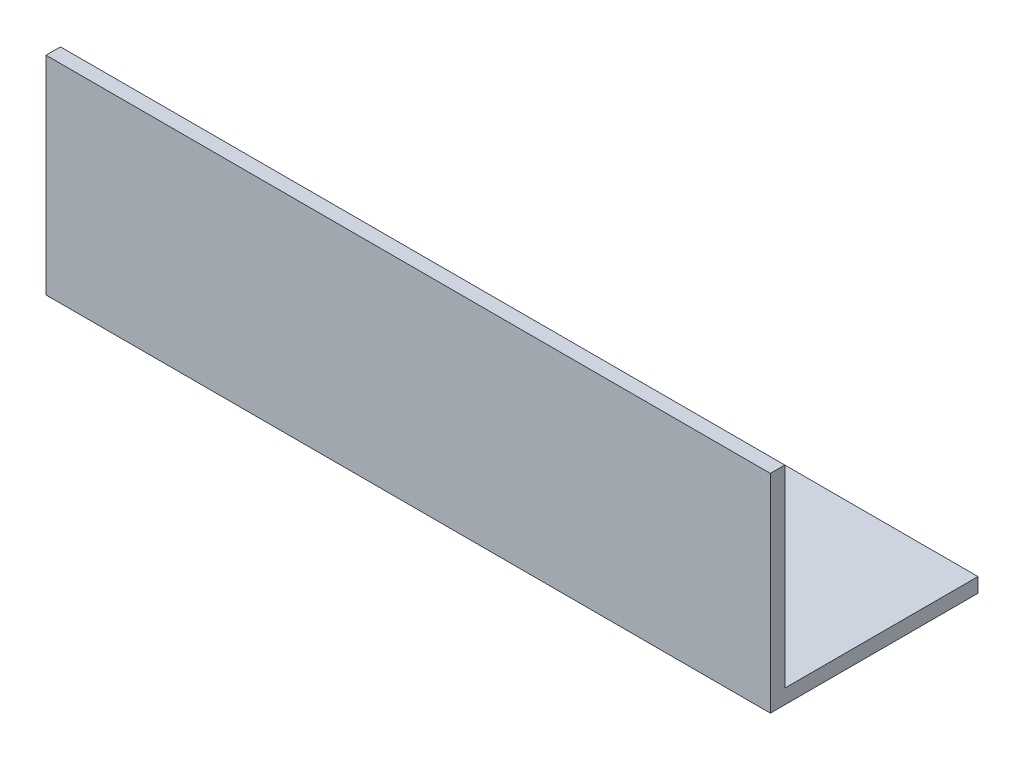
ISO-10303-21;
HEADER;
FILE_DESCRIPTION(('STEP AP214'),'2;1');
FILE_NAME('part.step','',(''),(''),'','','');
FILE_SCHEMA(('AUTOMOTIVE_DESIGN { 1 0 10303 214 1 1 1 1 }'));
ENDSEC;
DATA;
#1=APPLICATION_CONTEXT('core data for automotive mechanical design processes');
#2=APPLICATION_PROTOCOL_DEFINITION('international standard','automotive_design',2000,#1);
#3=PRODUCT_CONTEXT('',#1,'mechanical');
#4=PRODUCT('Part','Part','',(#3));
#5=PRODUCT_RELATED_PRODUCT_CATEGORY('part','',(#4));
#6=PRODUCT_DEFINITION_FORMATION('','',#4);
#7=PRODUCT_DEFINITION_CONTEXT('part definition',#1,'design');
#8=PRODUCT_DEFINITION('design','',#6,#7);
#9=PRODUCT_DEFINITION_SHAPE('','',#8);
#10=(LENGTH_UNIT() NAMED_UNIT(*) SI_UNIT(.MILLI.,.METRE.));
#11=(NAMED_UNIT(*) PLANE_ANGLE_UNIT() SI_UNIT($,.RADIAN.));
#12=(NAMED_UNIT(*) SI_UNIT($,.STERADIAN.) SOLID_ANGLE_UNIT());
#13=UNCERTAINTY_MEASURE_WITH_UNIT(LENGTH_MEASURE(1.E-05),#10,'distance_accuracy_value','');
#14=(GEOMETRIC_REPRESENTATION_CONTEXT(3) GLOBAL_UNCERTAINTY_ASSIGNED_CONTEXT((#13)) GLOBAL_UNIT_ASSIGNED_CONTEXT((#10,
#11,#12)) REPRESENTATION_CONTEXT('',''));
#15=CARTESIAN_POINT('',(0.,0.,0.));
#16=DIRECTION('',(0.,0.,1.));
#17=DIRECTION('',(1.,0.,0.));
#18=AXIS2_PLACEMENT_3D('',#15,#16,#17);
#19=CARTESIAN_POINT('',(150.,-3.,0.));
#20=DIRECTION('',(0.,1.,0.));
#21=DIRECTION('',(0.,0.,1.));
#22=AXIS2_PLACEMENT_3D('',#19,#20,#21);
#23=PLANE('',#22);
#24=DIRECTION('',(0.,0.,-1.));
#25=VECTOR('',#24,1.);
#26=CARTESIAN_POINT('',(0.,-3.,0.));
#27=LINE('',#26,#25);
#28=CARTESIAN_POINT('',(0.,-3.,3.));
#29=VERTEX_POINT('',#28);
#30=CARTESIAN_POINT('',(0.,-3.,-40.));
#31=VERTEX_POINT('',#30);
#32=EDGE_CURVE('E125',#29,#31,#27,.T.);
#33=ORIENTED_EDGE('',*,*,#32,.T.);
#34=DIRECTION('',(-1.,0.,0.));
#35=VECTOR('',#34,1.);
#36=CARTESIAN_POINT('',(150.,-3.,-40.));
#37=LINE('',#36,#35);
#38=CARTESIAN_POINT('',(150.,-3.,-40.));
#39=VERTEX_POINT('',#38);
#40=EDGE_CURVE('E11',#39,#31,#37,.T.);
#41=ORIENTED_EDGE('',*,*,#40,.F.);
#42=DIRECTION('',(0.,0.,-1.));
#43=VECTOR('',#42,1.);
#44=CARTESIAN_POINT('',(150.,-3.,0.));
#45=LINE('',#44,#43);
#46=CARTESIAN_POINT('',(150.,-3.,3.));
#47=VERTEX_POINT('',#46);
#48=EDGE_CURVE('E86',#47,#39,#45,.T.);
#49=ORIENTED_EDGE('',*,*,#48,.F.);
#50=DIRECTION('',(-1.,0.,0.));
#51=VECTOR('',#50,1.);
#52=CARTESIAN_POINT('',(150.,-3.,3.));
#53=LINE('',#52,#51);
#54=EDGE_CURVE('E121',#47,#29,#53,.T.);
#55=ORIENTED_EDGE('',*,*,#54,.T.);
#56=EDGE_LOOP('',(#33,#41,#49,#55));
#57=FACE_BOUND('',#56,.T.);
#58=ADVANCED_FACE('F39',(#57),#23,.F.);
#59=CARTESIAN_POINT('',(150.,0.,-40.));
#60=DIRECTION('',(0.,0.,-1.));
#61=DIRECTION('',(-1.,0.,0.));
#62=AXIS2_PLACEMENT_3D('',#59,#60,#61);
#63=PLANE('',#62);
#64=DIRECTION('',(0.,-1.,0.));
#65=VECTOR('',#64,1.);
#66=CARTESIAN_POINT('',(0.,0.,-40.));
#67=LINE('',#66,#65);
#68=CARTESIAN_POINT('',(0.,0.,-40.));
#69=VERTEX_POINT('',#68);
#70=EDGE_CURVE('E129',#69,#31,#67,.T.);
#71=ORIENTED_EDGE('',*,*,#70,.F.);
#72=DIRECTION('',(-1.,0.,0.));
#73=VECTOR('',#72,1.);
#74=CARTESIAN_POINT('',(150.,0.,-40.));
#75=LINE('',#74,#73);
#76=CARTESIAN_POINT('',(150.,0.,-40.));
#77=VERTEX_POINT('',#76);
#78=EDGE_CURVE('E48',#77,#69,#75,.T.);
#79=ORIENTED_EDGE('',*,*,#78,.F.);
#80=DIRECTION('',(0.,-1.,0.));
#81=VECTOR('',#80,1.);
#82=CARTESIAN_POINT('',(150.,0.,-40.));
#83=LINE('',#82,#81);
#84=EDGE_CURVE('E225',#77,#39,#83,.T.);
#85=ORIENTED_EDGE('',*,*,#84,.T.);
#86=ORIENTED_EDGE('',*,*,#40,.T.);
#87=EDGE_LOOP('',(#71,#79,#85,#86));
#88=FACE_BOUND('',#87,.T.);
#89=ADVANCED_FACE('F156',(#88),#63,.T.);
#90=CARTESIAN_POINT('',(150.,0.,0.));
#91=DIRECTION('',(0.,1.,0.));
#92=DIRECTION('',(0.,0.,1.));
#93=AXIS2_PLACEMENT_3D('',#90,#91,#92);
#94=PLANE('',#93);
#95=DIRECTION('',(0.,0.,-1.));
#96=VECTOR('',#95,1.);
#97=CARTESIAN_POINT('',(0.,0.,0.));
#98=LINE('',#97,#96);
#99=CARTESIAN_POINT('',(0.,0.,0.));
#100=VERTEX_POINT('',#99);
#101=EDGE_CURVE('E133',#100,#69,#98,.T.);
#102=ORIENTED_EDGE('',*,*,#101,.F.);
#103=DIRECTION('',(-1.,0.,0.));
#104=VECTOR('',#103,1.);
#105=CARTESIAN_POINT('',(150.,0.,0.));
#106=LINE('',#105,#104);
#107=CARTESIAN_POINT('',(150.,0.,0.));
#108=VERTEX_POINT('',#107);
#109=EDGE_CURVE('E108',#108,#100,#106,.T.);
#110=ORIENTED_EDGE('',*,*,#109,.F.);
#111=DIRECTION('',(0.,0.,-1.));
#112=VECTOR('',#111,1.);
#113=CARTESIAN_POINT('',(150.,0.,0.));
#114=LINE('',#113,#112);
#115=EDGE_CURVE('E114',#108,#77,#114,.T.);
#116=ORIENTED_EDGE('',*,*,#115,.T.);
#117=ORIENTED_EDGE('',*,*,#78,.T.);
#118=EDGE_LOOP('',(#102,#110,#116,#117));
#119=FACE_BOUND('',#118,.T.);
#120=ADVANCED_FACE('F153',(#119),#94,.T.);
#121=CARTESIAN_POINT('',(150.,40.,0.));
#122=DIRECTION('',(0.,0.,-1.));
#123=DIRECTION('',(0.,1.,0.));
#124=AXIS2_PLACEMENT_3D('',#121,#122,#123);
#125=PLANE('',#124);
#126=DIRECTION('',(0.,-1.,0.));
#127=VECTOR('',#126,1.);
#128=CARTESIAN_POINT('',(0.,40.,0.));
#129=LINE('',#128,#127);
#130=CARTESIAN_POINT('',(0.,40.,0.));
#131=VERTEX_POINT('',#130);
#132=EDGE_CURVE('E102',#131,#100,#129,.T.);
#133=ORIENTED_EDGE('',*,*,#132,.F.);
#134=DIRECTION('',(-1.,0.,0.));
#135=VECTOR('',#134,1.);
#136=CARTESIAN_POINT('',(150.,40.,0.));
#137=LINE('',#136,#135);
#138=CARTESIAN_POINT('',(150.,40.,0.));
#139=VERTEX_POINT('',#138);
#140=EDGE_CURVE('E97',#139,#131,#137,.T.);
#141=ORIENTED_EDGE('',*,*,#140,.F.);
#142=DIRECTION('',(0.,-1.,0.));
#143=VECTOR('',#142,1.);
#144=CARTESIAN_POINT('',(150.,40.,0.));
#145=LINE('',#144,#143);
#146=EDGE_CURVE('E100',#139,#108,#145,.T.);
#147=ORIENTED_EDGE('',*,*,#146,.T.);
#148=ORIENTED_EDGE('',*,*,#109,.T.);
#149=EDGE_LOOP('',(#133,#141,#147,#148));
#150=FACE_BOUND('',#149,.T.);
#151=ADVANCED_FACE('F99',(#150),#125,.T.);
#152=CARTESIAN_POINT('',(150.,40.,3.));
#153=DIRECTION('',(0.,1.,0.));
#154=DIRECTION('',(0.,0.,1.));
#155=AXIS2_PLACEMENT_3D('',#152,#153,#154);
#156=PLANE('',#155);
#157=DIRECTION('',(0.,0.,-1.));
#158=VECTOR('',#157,1.);
#159=CARTESIAN_POINT('',(0.,40.,3.));
#160=LINE('',#159,#158);
#161=CARTESIAN_POINT('',(0.,40.,3.));
#162=VERTEX_POINT('',#161);
#163=EDGE_CURVE('E139',#162,#131,#160,.T.);
#164=ORIENTED_EDGE('',*,*,#163,.F.);
#165=DIRECTION('',(-1.,0.,0.));
#166=VECTOR('',#165,1.);
#167=CARTESIAN_POINT('',(150.,40.,3.));
#168=LINE('',#167,#166);
#169=CARTESIAN_POINT('',(150.,40.,3.));
#170=VERTEX_POINT('',#169);
#171=EDGE_CURVE('E77',#170,#162,#168,.T.);
#172=ORIENTED_EDGE('',*,*,#171,.F.);
#173=DIRECTION('',(0.,0.,-1.));
#174=VECTOR('',#173,1.);
#175=CARTESIAN_POINT('',(150.,40.,3.));
#176=LINE('',#175,#174);
#177=EDGE_CURVE('E112',#170,#139,#176,.T.);
#178=ORIENTED_EDGE('',*,*,#177,.T.);
#179=ORIENTED_EDGE('',*,*,#140,.T.);
#180=EDGE_LOOP('',(#164,#172,#178,#179));
#181=FACE_BOUND('',#180,.T.);
#182=ADVANCED_FACE('F117',(#181),#156,.T.);
#183=CARTESIAN_POINT('',(150.,40.,3.));
#184=DIRECTION('',(0.,0.,-1.));
#185=DIRECTION('',(0.,1.,0.));
#186=AXIS2_PLACEMENT_3D('',#183,#184,#185);
#187=PLANE('',#186);
#188=DIRECTION('',(0.,-1.,0.));
#189=VECTOR('',#188,1.);
#190=CARTESIAN_POINT('',(0.,40.,3.));
#191=LINE('',#190,#189);
#192=EDGE_CURVE('E80',#162,#29,#191,.T.);
#193=ORIENTED_EDGE('',*,*,#192,.T.);
#194=ORIENTED_EDGE('',*,*,#54,.F.);
#195=DIRECTION('',(0.,-1.,0.));
#196=VECTOR('',#195,1.);
#197=CARTESIAN_POINT('',(150.,40.,3.));
#198=LINE('',#197,#196);
#199=EDGE_CURVE('E56',#170,#47,#198,.T.);
#200=ORIENTED_EDGE('',*,*,#199,.F.);
#201=ORIENTED_EDGE('',*,*,#171,.T.);
#202=EDGE_LOOP('',(#193,#194,#200,#201));
#203=FACE_BOUND('',#202,.T.);
#204=ADVANCED_FACE('F161',(#203),#187,.F.);
#205=CARTESIAN_POINT('',(150.,0.,0.));
#206=DIRECTION('',(-1.,0.,0.));
#207=DIRECTION('',(0.,0.,1.));
#208=AXIS2_PLACEMENT_3D('',#205,#206,#207);
#209=PLANE('',#208);
#210=ORIENTED_EDGE('',*,*,#48,.T.);
#211=ORIENTED_EDGE('',*,*,#84,.F.);
#212=ORIENTED_EDGE('',*,*,#115,.F.);
#213=ORIENTED_EDGE('',*,*,#146,.F.);
#214=ORIENTED_EDGE('',*,*,#177,.F.);
#215=ORIENTED_EDGE('',*,*,#199,.T.);
#216=EDGE_LOOP('',(#210,#211,#212,#213,#214,#215));
#217=FACE_BOUND('',#216,.T.);
#218=ADVANCED_FACE('F111',(#217),#209,.F.);
#219=CARTESIAN_POINT('',(0.,0.,0.));
#220=DIRECTION('',(-1.,0.,0.));
#221=DIRECTION('',(0.,0.,1.));
#222=AXIS2_PLACEMENT_3D('',#219,#220,#221);
#223=PLANE('',#222);
#224=ORIENTED_EDGE('',*,*,#32,.F.);
#225=ORIENTED_EDGE('',*,*,#192,.F.);
#226=ORIENTED_EDGE('',*,*,#163,.T.);
#227=ORIENTED_EDGE('',*,*,#132,.T.);
#228=ORIENTED_EDGE('',*,*,#101,.T.);
#229=ORIENTED_EDGE('',*,*,#70,.T.);
#230=EDGE_LOOP('',(#224,#225,#226,#227,#228,#229));
#231=FACE_BOUND('',#230,.T.);
#232=ADVANCED_FACE('F159',(#231),#223,.T.);
#233=CLOSED_SHELL('',(#58,#89,#120,#151,#182,#204,#218,#232));
#234=MANIFOLD_SOLID_BREP('B2',#233);
#235=ADVANCED_BREP_SHAPE_REPRESENTATION('',(#18,#234),#14);
#236=SHAPE_DEFINITION_REPRESENTATION(#9,#235);
ENDSEC;
END-ISO-10303-21;
